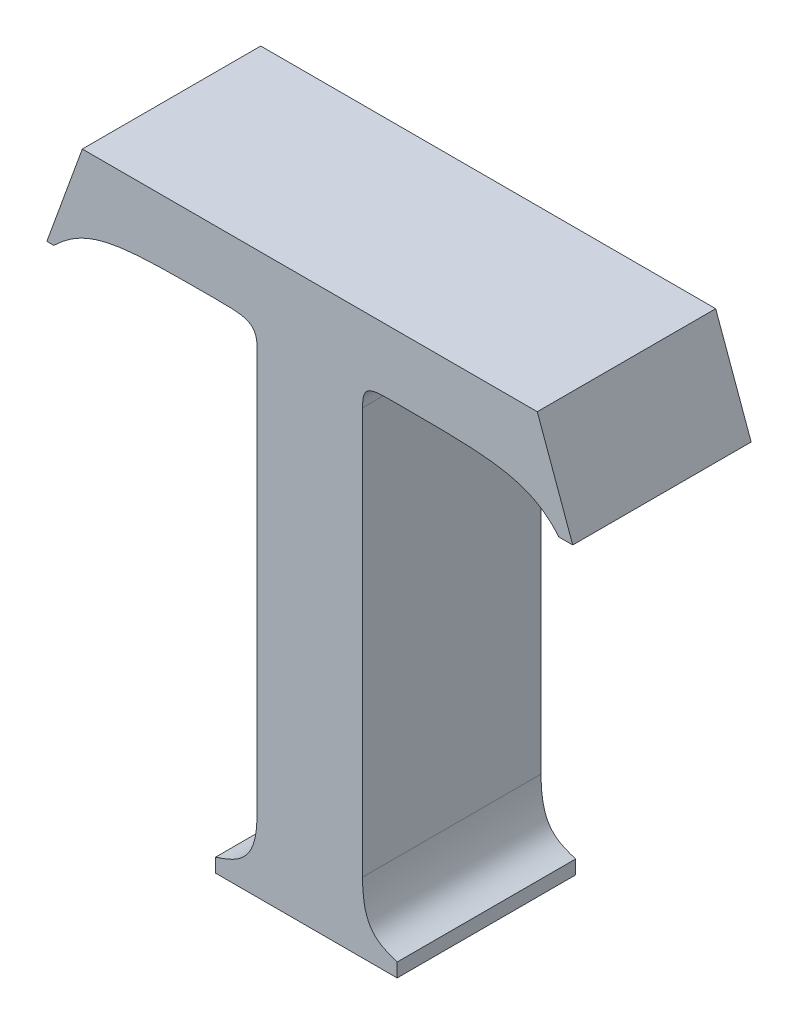
ISO-10303-21;
HEADER;
FILE_DESCRIPTION(('STEP AP214'),'2;1');
FILE_NAME('part.step','',(''),(''),'','','');
FILE_SCHEMA(('AUTOMOTIVE_DESIGN { 1 0 10303 214 1 1 1 1 }'));
ENDSEC;
DATA;
#1=APPLICATION_CONTEXT('core data for automotive mechanical design processes');
#2=APPLICATION_PROTOCOL_DEFINITION('international standard','automotive_design',2000,#1);
#3=PRODUCT_CONTEXT('',#1,'mechanical');
#4=PRODUCT('Part','Part','',(#3));
#5=PRODUCT_RELATED_PRODUCT_CATEGORY('part','',(#4));
#6=PRODUCT_DEFINITION_FORMATION('','',#4);
#7=PRODUCT_DEFINITION_CONTEXT('part definition',#1,'design');
#8=PRODUCT_DEFINITION('design','',#6,#7);
#9=PRODUCT_DEFINITION_SHAPE('','',#8);
#10=(LENGTH_UNIT() NAMED_UNIT(*) SI_UNIT(.MILLI.,.METRE.));
#11=(NAMED_UNIT(*) PLANE_ANGLE_UNIT() SI_UNIT($,.RADIAN.));
#12=(NAMED_UNIT(*) SI_UNIT($,.STERADIAN.) SOLID_ANGLE_UNIT());
#13=UNCERTAINTY_MEASURE_WITH_UNIT(LENGTH_MEASURE(1.E-05),#10,'distance_accuracy_value','');
#14=(GEOMETRIC_REPRESENTATION_CONTEXT(3) GLOBAL_UNCERTAINTY_ASSIGNED_CONTEXT((#13)) GLOBAL_UNIT_ASSIGNED_CONTEXT((#10,
#11,#12)) REPRESENTATION_CONTEXT('',''));
#15=CARTESIAN_POINT('',(0.,0.,0.));
#16=DIRECTION('',(0.,0.,1.));
#17=DIRECTION('',(1.,0.,0.));
#18=AXIS2_PLACEMENT_3D('',#15,#16,#17);
#19=CARTESIAN_POINT('',(2.2842877092406,-0.0613175045024918,0.));
#20=CARTESIAN_POINT('',(2.2842877092406,-0.0613175045024918,0.1));
#21=CARTESIAN_POINT('',(2.2726525955467,-0.0574392166259217,0.));
#22=CARTESIAN_POINT('',(2.2726525955467,-0.0574392166259217,0.1));
#23=CARTESIAN_POINT('',(2.264896452642,-0.0535611095522251,0.));
#24=CARTESIAN_POINT('',(2.264896452642,-0.0535611095522251,0.1));
#25=CARTESIAN_POINT('',(2.2648964516406,-0.0298073234104864,0.));
#26=CARTESIAN_POINT('',(2.2648964516406,-0.0298073234104864,0.1));
#27=B_SPLINE_SURFACE_WITH_KNOTS('',3,1,((#19,#20),(#21,#22),(#23,#24),(#25,#26)),.UNSPECIFIED.,
.F.,.F.,.F.,(4,4),(2,2),(-1.,0.),(0.,0.01),.UNSPECIFIED.);
#28=CARTESIAN_POINT('',(2.2648964516406,-0.0298073234104864,0.));
#29=CARTESIAN_POINT('',(2.264896452642,-0.0535611095522251,0.));
#30=CARTESIAN_POINT('',(2.2726525955467,-0.0574392166259217,0.));
#31=CARTESIAN_POINT('',(2.2842877092406,-0.0613175045024918,0.));
#32=B_SPLINE_CURVE_WITH_KNOTS('',3,(#28,#29,#30,#31),.UNSPECIFIED.,.F.,.F.,(4,4),(0.,1.),.UNSPECIFIED.);
#33=CARTESIAN_POINT('',(2.2648964516406,-0.0298073234104864,0.));
#34=VERTEX_POINT('',#33);
#35=CARTESIAN_POINT('',(2.2842877092406,-0.0613175045024918,0.));
#36=VERTEX_POINT('',#35);
#37=EDGE_CURVE('E11',#34,#36,#32,.T.);
#38=DIRECTION('',(0.,0.,1.));
#39=VECTOR('',#38,1.);
#40=CARTESIAN_POINT('',(2.2648964516406,-0.0298073234104864,0.));
#41=LINE('',#40,#39);
#42=CARTESIAN_POINT('',(2.2648964516406,-0.0298073234104864,0.1));
#43=VERTEX_POINT('',#42);
#44=EDGE_CURVE('E28',#34,#43,#41,.T.);
#45=CARTESIAN_POINT('',(2.2842877092406,-0.0613175045024918,0.1));
#46=CARTESIAN_POINT('',(2.2726525955467,-0.0574392166259217,0.1));
#47=CARTESIAN_POINT('',(2.264896452642,-0.0535611095522251,0.1));
#48=CARTESIAN_POINT('',(2.2648964516406,-0.0298073234104864,0.1));
#49=B_SPLINE_CURVE_WITH_KNOTS('',3,(#45,#46,#47,#48),.UNSPECIFIED.,.F.,.F.,(4,4),(-1.,0.),.UNSPECIFIED.);
#50=CARTESIAN_POINT('',(2.2842877092406,-0.0613175045024918,0.1));
#51=VERTEX_POINT('',#50);
#52=EDGE_CURVE('E152',#51,#43,#49,.T.);
#53=DIRECTION('',(0.,0.,1.));
#54=VECTOR('',#53,1.);
#55=CARTESIAN_POINT('',(2.2842877092406,-0.0613175045024918,0.));
#56=LINE('',#55,#54);
#57=EDGE_CURVE('E307',#36,#51,#56,.T.);
#58=ORIENTED_EDGE('',*,*,#37,.F.);
#59=ORIENTED_EDGE('',*,*,#44,.T.);
#60=ORIENTED_EDGE('',*,*,#52,.F.);
#61=ORIENTED_EDGE('',*,*,#57,.F.);
#62=EDGE_LOOP('',(#58,#59,#60,#61));
#63=FACE_BOUND('',#62,.T.);
#64=ADVANCED_FACE('F17',(#63),#27,.T.);
#65=CARTESIAN_POINT('',(2.2842877092406,-0.0690738994527997,0.));
#66=DIRECTION('',(1.,0.,0.));
#67=DIRECTION('',(0.,1.,0.));
#68=AXIS2_PLACEMENT_3D('',#65,#66,#67);
#69=PLANE('',#68);
#70=DIRECTION('',(0.,-1.,0.));
#71=VECTOR('',#70,1.);
#72=CARTESIAN_POINT('',(2.2842877092406,-0.0613175045024918,0.));
#73=LINE('',#72,#71);
#74=CARTESIAN_POINT('',(2.2842877092406,-0.0690738994527997,0.));
#75=VERTEX_POINT('',#74);
#76=EDGE_CURVE('E305',#36,#75,#73,.T.);
#77=ORIENTED_EDGE('',*,*,#76,.F.);
#78=ORIENTED_EDGE('',*,*,#57,.T.);
#79=DIRECTION('',(0.,1.,0.));
#80=VECTOR('',#79,1.);
#81=CARTESIAN_POINT('',(2.2842877092406,-0.0613175045024918,0.1));
#82=LINE('',#81,#80);
#83=CARTESIAN_POINT('',(2.2842877092406,-0.0690738994527997,0.1));
#84=VERTEX_POINT('',#83);
#85=EDGE_CURVE('E303',#84,#51,#82,.T.);
#86=ORIENTED_EDGE('',*,*,#85,.F.);
#87=DIRECTION('',(0.,0.,1.));
#88=VECTOR('',#87,1.);
#89=CARTESIAN_POINT('',(2.2842877092406,-0.0690738994527997,0.));
#90=LINE('',#89,#88);
#91=EDGE_CURVE('E300',#75,#84,#90,.T.);
#92=ORIENTED_EDGE('',*,*,#91,.F.);
#93=EDGE_LOOP('',(#77,#78,#86,#92));
#94=FACE_BOUND('',#93,.T.);
#95=ADVANCED_FACE('F366',(#94),#69,.T.);
#96=CARTESIAN_POINT('',(2.1824846877381,-0.0690738994527997,0.));
#97=DIRECTION('',(0.,-1.,0.));
#98=DIRECTION('',(1.,0.,0.));
#99=AXIS2_PLACEMENT_3D('',#96,#97,#98);
#100=PLANE('',#99);
#101=DIRECTION('',(-1.,0.,0.));
#102=VECTOR('',#101,1.);
#103=CARTESIAN_POINT('',(2.2842877092406,-0.0690738994527997,0.));
#104=LINE('',#103,#102);
#105=CARTESIAN_POINT('',(2.1824846877381,-0.0690738994527997,0.));
#106=VERTEX_POINT('',#105);
#107=EDGE_CURVE('E298',#75,#106,#104,.T.);
#108=ORIENTED_EDGE('',*,*,#107,.F.);
#109=ORIENTED_EDGE('',*,*,#91,.T.);
#110=DIRECTION('',(1.,0.,0.));
#111=VECTOR('',#110,1.);
#112=CARTESIAN_POINT('',(2.2842877092406,-0.0690738994527997,0.1));
#113=LINE('',#112,#111);
#114=CARTESIAN_POINT('',(2.1824846877381,-0.0690738994527997,0.1));
#115=VERTEX_POINT('',#114);
#116=EDGE_CURVE('E295',#115,#84,#113,.T.);
#117=ORIENTED_EDGE('',*,*,#116,.F.);
#118=DIRECTION('',(0.,0.,1.));
#119=VECTOR('',#118,1.);
#120=CARTESIAN_POINT('',(2.1824846877381,-0.0690738994527997,0.));
#121=LINE('',#120,#119);
#122=EDGE_CURVE('E292',#106,#115,#121,.T.);
#123=ORIENTED_EDGE('',*,*,#122,.F.);
#124=EDGE_LOOP('',(#108,#109,#117,#123));
#125=FACE_BOUND('',#124,.T.);
#126=ADVANCED_FACE('F362',(#125),#100,.T.);
#127=CARTESIAN_POINT('',(2.1824846877381,-0.0613175045024918,0.));
#128=DIRECTION('',(-1.,0.,0.));
#129=DIRECTION('',(0.,-1.,0.));
#130=AXIS2_PLACEMENT_3D('',#127,#128,#129);
#131=PLANE('',#130);
#132=DIRECTION('',(0.,1.,0.));
#133=VECTOR('',#132,1.);
#134=CARTESIAN_POINT('',(2.1824846877381,-0.0690738994527997,0.));
#135=LINE('',#134,#133);
#136=CARTESIAN_POINT('',(2.1824846877381,-0.0613175045024918,0.));
#137=VERTEX_POINT('',#136);
#138=EDGE_CURVE('E290',#106,#137,#135,.T.);
#139=ORIENTED_EDGE('',*,*,#138,.F.);
#140=ORIENTED_EDGE('',*,*,#122,.T.);
#141=DIRECTION('',(0.,-1.,0.));
#142=VECTOR('',#141,1.);
#143=CARTESIAN_POINT('',(2.1824846877381,-0.0690738994527997,0.1));
#144=LINE('',#143,#142);
#145=CARTESIAN_POINT('',(2.1824846877381,-0.0613175045024918,0.1));
#146=VERTEX_POINT('',#145);
#147=EDGE_CURVE('E287',#146,#115,#144,.T.);
#148=ORIENTED_EDGE('',*,*,#147,.F.);
#149=DIRECTION('',(0.,0.,1.));
#150=VECTOR('',#149,1.);
#151=CARTESIAN_POINT('',(2.1824846877381,-0.0613175045024918,0.));
#152=LINE('',#151,#150);
#153=EDGE_CURVE('E281',#137,#146,#152,.T.);
#154=ORIENTED_EDGE('',*,*,#153,.F.);
#155=EDGE_LOOP('',(#139,#140,#148,#154));
#156=FACE_BOUND('',#155,.T.);
#157=ADVANCED_FACE('F358',(#156),#131,.T.);
#158=CARTESIAN_POINT('',(2.2057549174535,-0.0298073234104864,0.));
#159=CARTESIAN_POINT('',(2.2057549174535,-0.0298073234104864,0.1));
#160=CARTESIAN_POINT('',(2.2057549176168,-0.0535611100425609,0.));
#161=CARTESIAN_POINT('',(2.2057549176168,-0.0535611100425609,0.1));
#162=CARTESIAN_POINT('',(2.1941198026783,-0.0574392171978618,0.));
#163=CARTESIAN_POINT('',(2.1941198026783,-0.0574392171978618,0.1));
#164=CARTESIAN_POINT('',(2.1824846877381,-0.0613175045024918,0.));
#165=CARTESIAN_POINT('',(2.1824846877381,-0.0613175045024918,0.1));
#166=B_SPLINE_SURFACE_WITH_KNOTS('',3,1,((#158,#159),(#160,#161),(#162,#163),(#164,#165)),
.UNSPECIFIED.,.F.,.F.,.F.,(4,4),(2,2),(-1.,0.),(0.,0.01),.UNSPECIFIED.);
#167=CARTESIAN_POINT('',(2.1824846877381,-0.0613175045024918,0.));
#168=CARTESIAN_POINT('',(2.1941198026783,-0.0574392171978618,0.));
#169=CARTESIAN_POINT('',(2.2057549176168,-0.0535611100425609,0.));
#170=CARTESIAN_POINT('',(2.2057549174535,-0.0298073234104864,0.));
#171=B_SPLINE_CURVE_WITH_KNOTS('',3,(#167,#168,#169,#170),.UNSPECIFIED.,.F.,.F.,(4,4),(0.,1.),.UNSPECIFIED.);
#172=CARTESIAN_POINT('',(2.2057549174535,-0.0298073234104864,0.));
#173=VERTEX_POINT('',#172);
#174=EDGE_CURVE('E274',#137,#173,#171,.T.);
#175=CARTESIAN_POINT('',(2.2057549174535,-0.0298073234104864,0.1));
#176=CARTESIAN_POINT('',(2.2057549176168,-0.0535611100425609,0.1));
#177=CARTESIAN_POINT('',(2.1941198026783,-0.0574392171978618,0.1));
#178=CARTESIAN_POINT('',(2.1824846877381,-0.0613175045024918,0.1));
#179=B_SPLINE_CURVE_WITH_KNOTS('',3,(#175,#176,#177,#178),.UNSPECIFIED.,.F.,.F.,(4,4),(-1.,0.),.UNSPECIFIED.);
#180=CARTESIAN_POINT('',(2.2057549174535,-0.0298073234104864,0.1));
#181=VERTEX_POINT('',#180);
#182=EDGE_CURVE('E269',#181,#146,#179,.T.);
#183=DIRECTION('',(0.,0.,1.));
#184=VECTOR('',#183,1.);
#185=CARTESIAN_POINT('',(2.2057549174535,-0.0298073234104864,0.));
#186=LINE('',#185,#184);
#187=EDGE_CURVE('E266',#173,#181,#186,.T.);
#188=ORIENTED_EDGE('',*,*,#174,.F.);
#189=ORIENTED_EDGE('',*,*,#153,.T.);
#190=ORIENTED_EDGE('',*,*,#182,.F.);
#191=ORIENTED_EDGE('',*,*,#187,.F.);
#192=EDGE_LOOP('',(#188,#189,#190,#191));
#193=FACE_BOUND('',#192,.T.);
#194=ADVANCED_FACE('F354',(#193),#166,.T.);
#195=CARTESIAN_POINT('',(2.2057549174535,0.198035882012747,0.));
#196=DIRECTION('',(-1.,0.,0.));
#197=DIRECTION('',(0.,-1.,0.));
#198=AXIS2_PLACEMENT_3D('',#195,#196,#197);
#199=PLANE('',#198);
#200=DIRECTION('',(0.,1.,0.));
#201=VECTOR('',#200,1.);
#202=CARTESIAN_POINT('',(2.2057549174535,-0.0298073234104864,0.));
#203=LINE('',#202,#201);
#204=CARTESIAN_POINT('',(2.2057549174535,0.198035882012747,0.));
#205=VERTEX_POINT('',#204);
#206=EDGE_CURVE('E264',#173,#205,#203,.T.);
#207=ORIENTED_EDGE('',*,*,#206,.F.);
#208=ORIENTED_EDGE('',*,*,#187,.T.);
#209=DIRECTION('',(0.,-1.,0.));
#210=VECTOR('',#209,1.);
#211=CARTESIAN_POINT('',(2.2057549174535,-0.0298073234104864,0.1));
#212=LINE('',#211,#210);
#213=CARTESIAN_POINT('',(2.2057549174535,0.198035882012747,0.1));
#214=VERTEX_POINT('',#213);
#215=EDGE_CURVE('E261',#214,#181,#212,.T.);
#216=ORIENTED_EDGE('',*,*,#215,.F.);
#217=DIRECTION('',(0.,0.,1.));
#218=VECTOR('',#217,1.);
#219=CARTESIAN_POINT('',(2.2057549174535,0.198035882012747,0.));
#220=LINE('',#219,#218);
#221=EDGE_CURVE('E255',#205,#214,#220,.T.);
#222=ORIENTED_EDGE('',*,*,#221,.F.);
#223=EDGE_LOOP('',(#207,#208,#216,#222));
#224=FACE_BOUND('',#223,.T.);
#225=ADVANCED_FACE('F350',(#224),#199,.T.);
#226=CARTESIAN_POINT('',(2.1824846877381,0.209670384362987,0.));
#227=CARTESIAN_POINT('',(2.1824846877381,0.209670384362987,0.1));
#228=CARTESIAN_POINT('',(2.1979984144137,0.209670384362962,0.));
#229=CARTESIAN_POINT('',(2.1979984144137,0.209670384362962,0.1));
#230=CARTESIAN_POINT('',(2.2057549174534,0.209670384362962,0.));
#231=CARTESIAN_POINT('',(2.2057549174534,0.209670384362962,0.1));
#232=CARTESIAN_POINT('',(2.2057549174535,0.198035882012747,0.));
#233=CARTESIAN_POINT('',(2.2057549174535,0.198035882012747,0.1));
#234=B_SPLINE_SURFACE_WITH_KNOTS('',3,1,((#226,#227),(#228,#229),(#230,#231),(#232,#233)),
.UNSPECIFIED.,.F.,.F.,.F.,(4,4),(2,2),(-1.,0.),(0.,0.01),.UNSPECIFIED.);
#235=CARTESIAN_POINT('',(2.2057549174535,0.198035882012747,0.));
#236=CARTESIAN_POINT('',(2.2057549174534,0.209670384362962,0.));
#237=CARTESIAN_POINT('',(2.1979984144137,0.209670384362962,0.));
#238=CARTESIAN_POINT('',(2.1824846877381,0.209670384362987,0.));
#239=B_SPLINE_CURVE_WITH_KNOTS('',3,(#235,#236,#237,#238),.UNSPECIFIED.,.F.,.F.,(4,4),(0.,1.),.UNSPECIFIED.);
#240=CARTESIAN_POINT('',(2.1824846877381,0.209670384362987,0.));
#241=VERTEX_POINT('',#240);
#242=EDGE_CURVE('E248',#205,#241,#239,.T.);
#243=CARTESIAN_POINT('',(2.1824846877381,0.209670384362987,0.1));
#244=CARTESIAN_POINT('',(2.1979984144137,0.209670384362962,0.1));
#245=CARTESIAN_POINT('',(2.2057549174534,0.209670384362962,0.1));
#246=CARTESIAN_POINT('',(2.2057549174535,0.198035882012747,0.1));
#247=B_SPLINE_CURVE_WITH_KNOTS('',3,(#243,#244,#245,#246),.UNSPECIFIED.,.F.,.F.,(4,4),(-1.,0.),.UNSPECIFIED.);
#248=CARTESIAN_POINT('',(2.1824846877381,0.209670384362987,0.1));
#249=VERTEX_POINT('',#248);
#250=EDGE_CURVE('E243',#249,#214,#247,.T.);
#251=DIRECTION('',(0.,0.,1.));
#252=VECTOR('',#251,1.);
#253=CARTESIAN_POINT('',(2.1824846877381,0.209670384362987,0.));
#254=LINE('',#253,#252);
#255=EDGE_CURVE('E237',#241,#249,#254,.T.);
#256=ORIENTED_EDGE('',*,*,#242,.F.);
#257=ORIENTED_EDGE('',*,*,#221,.T.);
#258=ORIENTED_EDGE('',*,*,#250,.F.);
#259=ORIENTED_EDGE('',*,*,#255,.F.);
#260=EDGE_LOOP('',(#256,#257,#258,#259));
#261=FACE_BOUND('',#260,.T.);
#262=ADVANCED_FACE('F346',(#261),#234,.T.);
#263=CARTESIAN_POINT('',(2.0918329003996,0.190279487061827,0.));
#264=CARTESIAN_POINT('',(2.0918329003996,0.190279487061827,0.1));
#265=CARTESIAN_POINT('',(2.1117080386925,0.209670382871547,0.));
#266=CARTESIAN_POINT('',(2.1117080386925,0.209670382871547,0.1));
#267=CARTESIAN_POINT('',(2.1310992962924,0.209670383280041,0.));
#268=CARTESIAN_POINT('',(2.1310992962924,0.209670383280041,0.1));
#269=CARTESIAN_POINT('',(2.1824846877381,0.209670384362987,0.));
#270=CARTESIAN_POINT('',(2.1824846877381,0.209670384362987,0.1));
#271=B_SPLINE_SURFACE_WITH_KNOTS('',3,1,((#263,#264),(#265,#266),(#267,#268),(#269,#270)),
.UNSPECIFIED.,.F.,.F.,.F.,(4,4),(2,2),(-1.,0.),(0.,0.01),.UNSPECIFIED.);
#272=CARTESIAN_POINT('',(2.1824846877381,0.209670384362987,0.));
#273=CARTESIAN_POINT('',(2.1310992962924,0.209670383280041,0.));
#274=CARTESIAN_POINT('',(2.1117080386925,0.209670382871547,0.));
#275=CARTESIAN_POINT('',(2.0918329003996,0.190279487061827,0.));
#276=B_SPLINE_CURVE_WITH_KNOTS('',3,(#272,#273,#274,#275),.UNSPECIFIED.,.F.,.F.,(4,4),(0.,1.),.UNSPECIFIED.);
#277=CARTESIAN_POINT('',(2.0918329003996,0.190279487061827,0.));
#278=VERTEX_POINT('',#277);
#279=EDGE_CURVE('E230',#241,#278,#276,.T.);
#280=CARTESIAN_POINT('',(2.0918329003996,0.190279487061827,0.1));
#281=CARTESIAN_POINT('',(2.1117080386925,0.209670382871547,0.1));
#282=CARTESIAN_POINT('',(2.1310992962924,0.209670383280041,0.1));
#283=CARTESIAN_POINT('',(2.1824846877381,0.209670384362987,0.1));
#284=B_SPLINE_CURVE_WITH_KNOTS('',3,(#280,#281,#282,#283),.UNSPECIFIED.,.F.,.F.,(4,4),(-1.,0.),.UNSPECIFIED.);
#285=CARTESIAN_POINT('',(2.0918329003996,0.190279487061827,0.1));
#286=VERTEX_POINT('',#285);
#287=EDGE_CURVE('E225',#286,#249,#284,.T.);
#288=DIRECTION('',(0.,0.,1.));
#289=VECTOR('',#288,1.);
#290=CARTESIAN_POINT('',(2.0918329003996,0.190279487061827,0.));
#291=LINE('',#290,#289);
#292=EDGE_CURVE('E222',#278,#286,#291,.T.);
#293=ORIENTED_EDGE('',*,*,#279,.F.);
#294=ORIENTED_EDGE('',*,*,#255,.T.);
#295=ORIENTED_EDGE('',*,*,#287,.F.);
#296=ORIENTED_EDGE('',*,*,#292,.F.);
#297=EDGE_LOOP('',(#293,#294,#295,#296));
#298=FACE_BOUND('',#297,.T.);
#299=ADVANCED_FACE('F342',(#298),#271,.T.);
#300=CARTESIAN_POINT('',(2.087953928283,0.190279487061827,0.));
#301=DIRECTION('',(0.,-1.,0.));
#302=DIRECTION('',(1.,0.,0.));
#303=AXIS2_PLACEMENT_3D('',#300,#301,#302);
#304=PLANE('',#303);
#305=DIRECTION('',(-1.,0.,0.));
#306=VECTOR('',#305,1.);
#307=CARTESIAN_POINT('',(2.0918329003996,0.190279487061827,0.));
#308=LINE('',#307,#306);
#309=CARTESIAN_POINT('',(2.087953928283,0.190279487061827,0.));
#310=VERTEX_POINT('',#309);
#311=EDGE_CURVE('E220',#278,#310,#308,.T.);
#312=ORIENTED_EDGE('',*,*,#311,.F.);
#313=ORIENTED_EDGE('',*,*,#292,.T.);
#314=DIRECTION('',(1.,0.,0.));
#315=VECTOR('',#314,1.);
#316=CARTESIAN_POINT('',(2.0918329003996,0.190279487061827,0.1));
#317=LINE('',#316,#315);
#318=CARTESIAN_POINT('',(2.087953928283,0.190279487061827,0.1));
#319=VERTEX_POINT('',#318);
#320=EDGE_CURVE('E217',#319,#286,#317,.T.);
#321=ORIENTED_EDGE('',*,*,#320,.F.);
#322=DIRECTION('',(0.,0.,1.));
#323=VECTOR('',#322,1.);
#324=CARTESIAN_POINT('',(2.087953928283,0.190279487061827,0.));
#325=LINE('',#324,#323);
#326=EDGE_CURVE('E214',#310,#319,#325,.T.);
#327=ORIENTED_EDGE('',*,*,#326,.F.);
#328=EDGE_LOOP('',(#312,#313,#321,#327));
#329=FACE_BOUND('',#328,.T.);
#330=ADVANCED_FACE('F338',(#329),#304,.T.);
#331=CARTESIAN_POINT('',(2.10783050777,0.245058816975212,0.));
#332=DIRECTION('',(-0.940031158167789,0.341088583323638,0.));
#333=DIRECTION('',(-0.341088583323638,-0.940031158167789,0.));
#334=AXIS2_PLACEMENT_3D('',#331,#332,#333);
#335=PLANE('',#334);
#336=DIRECTION('',(0.341088583323638,0.940031158167789,0.));
#337=VECTOR('',#336,1.);
#338=CARTESIAN_POINT('',(2.087953928283,0.190279487061827,0.));
#339=LINE('',#338,#337);
#340=CARTESIAN_POINT('',(2.10783050777,0.245058816975212,0.));
#341=VERTEX_POINT('',#340);
#342=EDGE_CURVE('E212',#310,#341,#339,.T.);
#343=ORIENTED_EDGE('',*,*,#342,.F.);
#344=ORIENTED_EDGE('',*,*,#326,.T.);
#345=DIRECTION('',(-0.341088583323638,-0.940031158167789,0.));
#346=VECTOR('',#345,1.);
#347=CARTESIAN_POINT('',(2.087953928283,0.190279487061827,0.1));
#348=LINE('',#347,#346);
#349=CARTESIAN_POINT('',(2.10783050777,0.245058816975212,0.1));
#350=VERTEX_POINT('',#349);
#351=EDGE_CURVE('E209',#350,#319,#348,.T.);
#352=ORIENTED_EDGE('',*,*,#351,.F.);
#353=DIRECTION('',(0.,0.,1.));
#354=VECTOR('',#353,1.);
#355=CARTESIAN_POINT('',(2.10783050777,0.245058816975212,0.));
#356=LINE('',#355,#354);
#357=EDGE_CURVE('E206',#341,#350,#356,.T.);
#358=ORIENTED_EDGE('',*,*,#357,.F.);
#359=EDGE_LOOP('',(#343,#344,#352,#358));
#360=FACE_BOUND('',#359,.T.);
#361=ADVANCED_FACE('F334',(#360),#335,.T.);
#362=CARTESIAN_POINT('',(2.3628205010265,0.245058816975212,0.));
#363=DIRECTION('',(0.,1.,0.));
#364=DIRECTION('',(-1.,0.,0.));
#365=AXIS2_PLACEMENT_3D('',#362,#363,#364);
#366=PLANE('',#365);
#367=DIRECTION('',(1.,0.,0.));
#368=VECTOR('',#367,1.);
#369=CARTESIAN_POINT('',(2.10783050777,0.245058816975212,0.));
#370=LINE('',#369,#368);
#371=CARTESIAN_POINT('',(2.3628205010265,0.245058816975212,0.));
#372=VERTEX_POINT('',#371);
#373=EDGE_CURVE('E204',#341,#372,#370,.T.);
#374=ORIENTED_EDGE('',*,*,#373,.F.);
#375=ORIENTED_EDGE('',*,*,#357,.T.);
#376=DIRECTION('',(-1.,0.,0.));
#377=VECTOR('',#376,1.);
#378=CARTESIAN_POINT('',(2.10783050777,0.245058816975212,0.1));
#379=LINE('',#378,#377);
#380=CARTESIAN_POINT('',(2.3628205010265,0.245058816975212,0.1));
#381=VERTEX_POINT('',#380);
#382=EDGE_CURVE('E201',#381,#350,#379,.T.);
#383=ORIENTED_EDGE('',*,*,#382,.F.);
#384=DIRECTION('',(0.,0.,1.));
#385=VECTOR('',#384,1.);
#386=CARTESIAN_POINT('',(2.3628205010265,0.245058816975212,0.));
#387=LINE('',#386,#385);
#388=EDGE_CURVE('E198',#372,#381,#387,.T.);
#389=ORIENTED_EDGE('',*,*,#388,.F.);
#390=EDGE_LOOP('',(#374,#375,#383,#389));
#391=FACE_BOUND('',#390,.T.);
#392=ADVANCED_FACE('F330',(#391),#366,.T.);
#393=CARTESIAN_POINT('',(2.3826956393206,0.190279487061827,0.));
#394=DIRECTION('',(0.940039087686152,0.341066728987434,0.));
#395=DIRECTION('',(-0.341066728987434,0.940039087686152,0.));
#396=AXIS2_PLACEMENT_3D('',#393,#394,#395);
#397=PLANE('',#396);
#398=DIRECTION('',(0.341066728987434,-0.940039087686152,0.));
#399=VECTOR('',#398,1.);
#400=CARTESIAN_POINT('',(2.3628205010265,0.245058816975212,0.));
#401=LINE('',#400,#399);
#402=CARTESIAN_POINT('',(2.3826956393206,0.190279487061827,0.));
#403=VERTEX_POINT('',#402);
#404=EDGE_CURVE('E196',#372,#403,#401,.T.);
#405=ORIENTED_EDGE('',*,*,#404,.F.);
#406=ORIENTED_EDGE('',*,*,#388,.T.);
#407=DIRECTION('',(-0.341066728987434,0.940039087686152,0.));
#408=VECTOR('',#407,1.);
#409=CARTESIAN_POINT('',(2.3628205010265,0.245058816975212,0.1));
#410=LINE('',#409,#408);
#411=CARTESIAN_POINT('',(2.3826956393206,0.190279487061827,0.1));
#412=VERTEX_POINT('',#411);
#413=EDGE_CURVE('E193',#412,#381,#410,.T.);
#414=ORIENTED_EDGE('',*,*,#413,.F.);
#415=DIRECTION('',(0.,0.,1.));
#416=VECTOR('',#415,1.);
#417=CARTESIAN_POINT('',(2.3826956393206,0.190279487061827,0.));
#418=LINE('',#417,#416);
#419=EDGE_CURVE('E190',#403,#412,#418,.T.);
#420=ORIENTED_EDGE('',*,*,#419,.F.);
#421=EDGE_LOOP('',(#405,#406,#414,#420));
#422=FACE_BOUND('',#421,.T.);
#423=ADVANCED_FACE('F326',(#422),#397,.T.);
#424=CARTESIAN_POINT('',(2.374939496579,0.190279487061827,0.));
#425=DIRECTION('',(0.,-1.,0.));
#426=DIRECTION('',(1.,0.,0.));
#427=AXIS2_PLACEMENT_3D('',#424,#425,#426);
#428=PLANE('',#427);
#429=DIRECTION('',(-1.,0.,0.));
#430=VECTOR('',#429,1.);
#431=CARTESIAN_POINT('',(2.3826956393206,0.190279487061827,0.));
#432=LINE('',#431,#430);
#433=CARTESIAN_POINT('',(2.374939496579,0.190279487061827,0.));
#434=VERTEX_POINT('',#433);
#435=EDGE_CURVE('E188',#403,#434,#432,.T.);
#436=ORIENTED_EDGE('',*,*,#435,.F.);
#437=ORIENTED_EDGE('',*,*,#419,.T.);
#438=DIRECTION('',(1.,0.,0.));
#439=VECTOR('',#438,1.);
#440=CARTESIAN_POINT('',(2.3826956393206,0.190279487061827,0.1));
#441=LINE('',#440,#439);
#442=CARTESIAN_POINT('',(2.374939496579,0.190279487061827,0.1));
#443=VERTEX_POINT('',#442);
#444=EDGE_CURVE('E185',#443,#412,#441,.T.);
#445=ORIENTED_EDGE('',*,*,#444,.F.);
#446=DIRECTION('',(0.,0.,1.));
#447=VECTOR('',#446,1.);
#448=CARTESIAN_POINT('',(2.374939496579,0.190279487061827,0.));
#449=LINE('',#448,#447);
#450=EDGE_CURVE('E179',#434,#443,#449,.T.);
#451=ORIENTED_EDGE('',*,*,#450,.F.);
#452=EDGE_LOOP('',(#436,#437,#445,#451));
#453=FACE_BOUND('',#452,.T.);
#454=ADVANCED_FACE('F322',(#453),#428,.T.);
#455=CARTESIAN_POINT('',(2.2842877092406,0.209670384362987,0.));
#456=CARTESIAN_POINT('',(2.2842877092406,0.209670384362987,0.1));
#457=CARTESIAN_POINT('',(2.3356727410846,0.20967038577551,0.));
#458=CARTESIAN_POINT('',(2.3356727410846,0.20967038577551,0.1));
#459=CARTESIAN_POINT('',(2.3589415296074,0.20967038493844,0.));
#460=CARTESIAN_POINT('',(2.3589415296074,0.20967038493844,0.1));
#461=CARTESIAN_POINT('',(2.374939496579,0.190279487061827,0.));
#462=CARTESIAN_POINT('',(2.374939496579,0.190279487061827,0.1));
#463=B_SPLINE_SURFACE_WITH_KNOTS('',3,1,((#455,#456),(#457,#458),(#459,#460),(#461,#462)),
.UNSPECIFIED.,.F.,.F.,.F.,(4,4),(2,2),(-1.,0.),(0.,0.01),.UNSPECIFIED.);
#464=CARTESIAN_POINT('',(2.374939496579,0.190279487061827,0.));
#465=CARTESIAN_POINT('',(2.3589415296074,0.20967038493844,0.));
#466=CARTESIAN_POINT('',(2.3356727410846,0.20967038577551,0.));
#467=CARTESIAN_POINT('',(2.2842877092406,0.209670384362987,0.));
#468=B_SPLINE_CURVE_WITH_KNOTS('',3,(#464,#465,#466,#467),.UNSPECIFIED.,.F.,.F.,(4,4),(0.,1.),.UNSPECIFIED.);
#469=CARTESIAN_POINT('',(2.2842877092406,0.209670384362987,0.));
#470=VERTEX_POINT('',#469);
#471=EDGE_CURVE('E172',#434,#470,#468,.T.);
#472=CARTESIAN_POINT('',(2.2842877092406,0.209670384362987,0.1));
#473=CARTESIAN_POINT('',(2.3356727410846,0.20967038577551,0.1));
#474=CARTESIAN_POINT('',(2.3589415296074,0.20967038493844,0.1));
#475=CARTESIAN_POINT('',(2.374939496579,0.190279487061827,0.1));
#476=B_SPLINE_CURVE_WITH_KNOTS('',3,(#472,#473,#474,#475),.UNSPECIFIED.,.F.,.F.,(4,4),(-1.,0.),.UNSPECIFIED.);
#477=CARTESIAN_POINT('',(2.2842877092406,0.209670384362987,0.1));
#478=VERTEX_POINT('',#477);
#479=EDGE_CURVE('E168',#478,#443,#476,.T.);
#480=DIRECTION('',(0.,0.,1.));
#481=VECTOR('',#480,1.);
#482=CARTESIAN_POINT('',(2.2842877092406,0.209670384362987,0.));
#483=LINE('',#482,#481);
#484=EDGE_CURVE('E137',#470,#478,#483,.T.);
#485=ORIENTED_EDGE('',*,*,#471,.F.);
#486=ORIENTED_EDGE('',*,*,#450,.T.);
#487=ORIENTED_EDGE('',*,*,#479,.F.);
#488=ORIENTED_EDGE('',*,*,#484,.F.);
#489=EDGE_LOOP('',(#485,#486,#487,#488));
#490=FACE_BOUND('',#489,.T.);
#491=ADVANCED_FACE('F320',(#490),#463,.T.);
#492=CARTESIAN_POINT('',(2.2648964516406,0.198035882012747,0.));
#493=CARTESIAN_POINT('',(2.2648964516406,0.198035882012747,0.1));
#494=CARTESIAN_POINT('',(2.2648964516406,0.209670383785057,0.));
#495=CARTESIAN_POINT('',(2.2648964516406,0.209670383785057,0.1));
#496=CARTESIAN_POINT('',(2.2687750634585,0.209670383900646,0.));
#497=CARTESIAN_POINT('',(2.2687750634585,0.209670383900646,0.1));
#498=CARTESIAN_POINT('',(2.2842877092406,0.209670384362987,0.));
#499=CARTESIAN_POINT('',(2.2842877092406,0.209670384362987,0.1));
#500=B_SPLINE_SURFACE_WITH_KNOTS('',3,1,((#492,#493),(#494,#495),(#496,#497),(#498,#499)),
.UNSPECIFIED.,.F.,.F.,.F.,(4,4),(2,2),(-1.,0.),(0.,0.01),.UNSPECIFIED.);
#501=CARTESIAN_POINT('',(2.2842877092406,0.209670384362987,0.));
#502=CARTESIAN_POINT('',(2.2687750634585,0.209670383900646,0.));
#503=CARTESIAN_POINT('',(2.2648964516406,0.209670383785057,0.));
#504=CARTESIAN_POINT('',(2.2648964516406,0.198035882012747,0.));
#505=B_SPLINE_CURVE_WITH_KNOTS('',3,(#501,#502,#503,#504),.UNSPECIFIED.,.F.,.F.,(4,4),(0.,1.),.UNSPECIFIED.);
#506=CARTESIAN_POINT('',(2.2648964516406,0.198035882012747,0.));
#507=VERTEX_POINT('',#506);
#508=EDGE_CURVE('E141',#470,#507,#505,.T.);
#509=CARTESIAN_POINT('',(2.2648964516406,0.198035882012747,0.1));
#510=CARTESIAN_POINT('',(2.2648964516406,0.209670383785057,0.1));
#511=CARTESIAN_POINT('',(2.2687750634585,0.209670383900646,0.1));
#512=CARTESIAN_POINT('',(2.2842877092406,0.209670384362987,0.1));
#513=B_SPLINE_CURVE_WITH_KNOTS('',3,(#509,#510,#511,#512),.UNSPECIFIED.,.F.,.F.,(4,4),(-1.,0.),.UNSPECIFIED.);
#514=CARTESIAN_POINT('',(2.2648964516406,0.198035882012747,0.1));
#515=VERTEX_POINT('',#514);
#516=EDGE_CURVE('E130',#515,#478,#513,.T.);
#517=DIRECTION('',(0.,0.,1.));
#518=VECTOR('',#517,1.);
#519=CARTESIAN_POINT('',(2.2648964516406,0.198035882012747,0.));
#520=LINE('',#519,#518);
#521=EDGE_CURVE('E134',#507,#515,#520,.T.);
#522=ORIENTED_EDGE('',*,*,#508,.F.);
#523=ORIENTED_EDGE('',*,*,#484,.T.);
#524=ORIENTED_EDGE('',*,*,#516,.F.);
#525=ORIENTED_EDGE('',*,*,#521,.F.);
#526=EDGE_LOOP('',(#522,#523,#524,#525));
#527=FACE_BOUND('',#526,.T.);
#528=ADVANCED_FACE('F133',(#527),#500,.T.);
#529=CARTESIAN_POINT('',(2.2648964516406,-0.0298073234104864,0.));
#530=DIRECTION('',(1.,0.,0.));
#531=DIRECTION('',(0.,1.,0.));
#532=AXIS2_PLACEMENT_3D('',#529,#530,#531);
#533=PLANE('',#532);
#534=DIRECTION('',(0.,-1.,0.));
#535=VECTOR('',#534,1.);
#536=CARTESIAN_POINT('',(2.2648964516406,0.198035882012747,0.));
#537=LINE('',#536,#535);
#538=EDGE_CURVE('E147',#507,#34,#537,.T.);
#539=ORIENTED_EDGE('',*,*,#538,.F.);
#540=ORIENTED_EDGE('',*,*,#521,.T.);
#541=DIRECTION('',(0.,1.,0.));
#542=VECTOR('',#541,1.);
#543=CARTESIAN_POINT('',(2.2648964516406,0.198035882012747,0.1));
#544=LINE('',#543,#542);
#545=EDGE_CURVE('E146',#43,#515,#544,.T.);
#546=ORIENTED_EDGE('',*,*,#545,.F.);
#547=ORIENTED_EDGE('',*,*,#44,.F.);
#548=EDGE_LOOP('',(#539,#540,#546,#547));
#549=FACE_BOUND('',#548,.T.);
#550=ADVANCED_FACE('F145',(#549),#533,.T.);
#551=CARTESIAN_POINT('',(2.235189197029,0.129179363279151,0.));
#552=DIRECTION('',(0.,0.,1.));
#553=DIRECTION('',(1.,0.,0.));
#554=AXIS2_PLACEMENT_3D('',#551,#552,#553);
#555=PLANE('',#554);
#556=ORIENTED_EDGE('',*,*,#538,.T.);
#557=ORIENTED_EDGE('',*,*,#37,.T.);
#558=ORIENTED_EDGE('',*,*,#76,.T.);
#559=ORIENTED_EDGE('',*,*,#107,.T.);
#560=ORIENTED_EDGE('',*,*,#138,.T.);
#561=ORIENTED_EDGE('',*,*,#174,.T.);
#562=ORIENTED_EDGE('',*,*,#206,.T.);
#563=ORIENTED_EDGE('',*,*,#242,.T.);
#564=ORIENTED_EDGE('',*,*,#279,.T.);
#565=ORIENTED_EDGE('',*,*,#311,.T.);
#566=ORIENTED_EDGE('',*,*,#342,.T.);
#567=ORIENTED_EDGE('',*,*,#373,.T.);
#568=ORIENTED_EDGE('',*,*,#404,.T.);
#569=ORIENTED_EDGE('',*,*,#435,.T.);
#570=ORIENTED_EDGE('',*,*,#471,.T.);
#571=ORIENTED_EDGE('',*,*,#508,.T.);
#572=EDGE_LOOP('',(#556,#557,#558,#559,#560,#561,#562,#563,#564,#565,#566,#567,#568,#569,#570,#571));
#573=FACE_BOUND('',#572,.T.);
#574=ADVANCED_FACE('F315',(#573),#555,.F.);
#575=CARTESIAN_POINT('',(2.235189197029,0.129179363279151,0.1));
#576=DIRECTION('',(0.,0.,1.));
#577=DIRECTION('',(1.,0.,0.));
#578=AXIS2_PLACEMENT_3D('',#575,#576,#577);
#579=PLANE('',#578);
#580=ORIENTED_EDGE('',*,*,#545,.T.);
#581=ORIENTED_EDGE('',*,*,#516,.T.);
#582=ORIENTED_EDGE('',*,*,#479,.T.);
#583=ORIENTED_EDGE('',*,*,#444,.T.);
#584=ORIENTED_EDGE('',*,*,#413,.T.);
#585=ORIENTED_EDGE('',*,*,#382,.T.);
#586=ORIENTED_EDGE('',*,*,#351,.T.);
#587=ORIENTED_EDGE('',*,*,#320,.T.);
#588=ORIENTED_EDGE('',*,*,#287,.T.);
#589=ORIENTED_EDGE('',*,*,#250,.T.);
#590=ORIENTED_EDGE('',*,*,#215,.T.);
#591=ORIENTED_EDGE('',*,*,#182,.T.);
#592=ORIENTED_EDGE('',*,*,#147,.T.);
#593=ORIENTED_EDGE('',*,*,#116,.T.);
#594=ORIENTED_EDGE('',*,*,#85,.T.);
#595=ORIENTED_EDGE('',*,*,#52,.T.);
#596=EDGE_LOOP('',(#580,#581,#582,#583,#584,#585,#586,#587,#588,#589,#590,#591,#592,#593,#594,#595));
#597=FACE_BOUND('',#596,.T.);
#598=ADVANCED_FACE('F150',(#597),#579,.T.);
#599=CLOSED_SHELL('',(#64,#95,#126,#157,#194,#225,#262,#299,#330,#361,#392,#423,#454,#491,#528,
#550,#574,#598));
#600=MANIFOLD_SOLID_BREP('B1',#599);
#601=ADVANCED_BREP_SHAPE_REPRESENTATION('',(#18,#600),#14);
#602=SHAPE_DEFINITION_REPRESENTATION(#9,#601);
ENDSEC;
END-ISO-10303-21;
